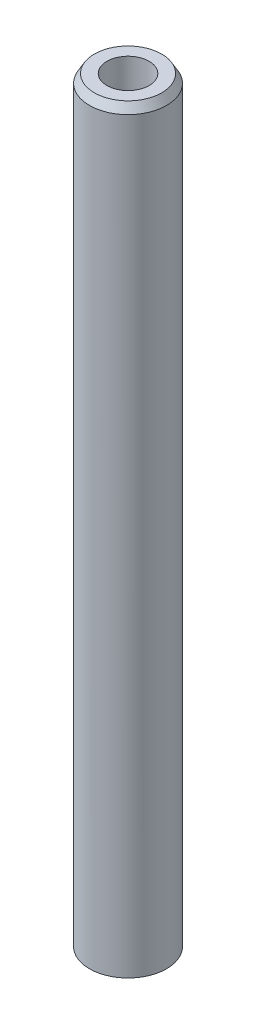
ISO-10303-21;
HEADER;
FILE_DESCRIPTION(('STEP AP214'),'2;1');
FILE_NAME('part.step','',(''),(''),'','','');
FILE_SCHEMA(('AUTOMOTIVE_DESIGN { 1 0 10303 214 1 1 1 1 }'));
ENDSEC;
DATA;
#1=APPLICATION_CONTEXT('core data for automotive mechanical design processes');
#2=APPLICATION_PROTOCOL_DEFINITION('international standard','automotive_design',2000,#1);
#3=PRODUCT_CONTEXT('',#1,'mechanical');
#4=PRODUCT('Part','Part','',(#3));
#5=PRODUCT_RELATED_PRODUCT_CATEGORY('part','',(#4));
#6=PRODUCT_DEFINITION_FORMATION('','',#4);
#7=PRODUCT_DEFINITION_CONTEXT('part definition',#1,'design');
#8=PRODUCT_DEFINITION('design','',#6,#7);
#9=PRODUCT_DEFINITION_SHAPE('','',#8);
#10=(LENGTH_UNIT() NAMED_UNIT(*) SI_UNIT(.MILLI.,.METRE.));
#11=(NAMED_UNIT(*) PLANE_ANGLE_UNIT() SI_UNIT($,.RADIAN.));
#12=(NAMED_UNIT(*) SI_UNIT($,.STERADIAN.) SOLID_ANGLE_UNIT());
#13=UNCERTAINTY_MEASURE_WITH_UNIT(LENGTH_MEASURE(1.E-05),#10,'distance_accuracy_value','');
#14=(GEOMETRIC_REPRESENTATION_CONTEXT(3) GLOBAL_UNCERTAINTY_ASSIGNED_CONTEXT((#13)) GLOBAL_UNIT_ASSIGNED_CONTEXT((#10,
#11,#12)) REPRESENTATION_CONTEXT('',''));
#15=CARTESIAN_POINT('',(0.,0.,0.));
#16=DIRECTION('',(0.,0.,1.));
#17=DIRECTION('',(1.,0.,0.));
#18=AXIS2_PLACEMENT_3D('',#15,#16,#17);
#19=CARTESIAN_POINT('',(0.,493.757873071022,0.));
#20=DIRECTION('',(0.,-1.,0.));
#21=DIRECTION('',(0.,0.,-1.));
#22=AXIS2_PLACEMENT_3D('',#19,#20,#21);
#23=CYLINDRICAL_SURFACE('',#22,25.);
#24=CARTESIAN_POINT('',(0.,488.245033458921,0.));
#25=DIRECTION('',(0.,1.,0.));
#26=DIRECTION('',(0.,0.,1.));
#27=AXIS2_PLACEMENT_3D('',#24,#25,#26);
#28=CIRCLE('',#27,25.);
#29=CARTESIAN_POINT('',(0.,488.245033458921,-25.));
#30=VERTEX_POINT('',#29);
#31=EDGE_CURVE('E50',#30,#30,#28,.F.);
#32=CARTESIAN_POINT('',(0.,3.18283943404574,0.));
#33=DIRECTION('',(0.,1.,0.));
#34=DIRECTION('',(0.,0.,1.));
#35=AXIS2_PLACEMENT_3D('',#32,#33,#34);
#36=CIRCLE('',#35,25.);
#37=CARTESIAN_POINT('',(0.,3.18283943404574,-25.));
#38=VERTEX_POINT('',#37);
#39=EDGE_CURVE('E51',#38,#38,#36,.T.);
#40=CARTESIAN_POINT('',(0.,488.245033458921,-25.));
#41=CARTESIAN_POINT('',(0.,483.192302271162,-25.));
#42=CARTESIAN_POINT('',(0.,478.139571083403,-25.));
#43=CARTESIAN_POINT('',(0.,468.034108707885,-25.));
#44=CARTESIAN_POINT('',(0.,462.981377520126,-25.));
#45=CARTESIAN_POINT('',(0.,452.875915144607,-25.));
#46=CARTESIAN_POINT('',(0.,447.823183956848,-25.));
#47=CARTESIAN_POINT('',(0.,437.71772158133,-25.));
#48=CARTESIAN_POINT('',(0.,432.664990393571,-25.));
#49=CARTESIAN_POINT('',(0.,422.559528018053,-25.));
#50=CARTESIAN_POINT('',(0.,417.506796830294,-25.));
#51=CARTESIAN_POINT('',(0.,407.401334454775,-25.));
#52=CARTESIAN_POINT('',(0.,402.348603267016,-25.));
#53=CARTESIAN_POINT('',(0.,392.243140891498,-25.));
#54=CARTESIAN_POINT('',(0.,387.190409703739,-25.));
#55=CARTESIAN_POINT('',(0.,377.084947328221,-25.));
#56=CARTESIAN_POINT('',(0.,372.032216140462,-25.));
#57=CARTESIAN_POINT('',(0.,361.926753764943,-25.));
#58=CARTESIAN_POINT('',(0.,356.874022577184,-25.));
#59=CARTESIAN_POINT('',(0.,346.768560201666,-25.));
#60=CARTESIAN_POINT('',(0.,341.715829013907,-25.));
#61=CARTESIAN_POINT('',(0.,331.610366638389,-25.));
#62=CARTESIAN_POINT('',(0.,326.557635450629,-25.));
#63=CARTESIAN_POINT('',(0.,316.452173075111,-25.));
#64=CARTESIAN_POINT('',(0.,311.399441887352,-25.));
#65=CARTESIAN_POINT('',(0.,301.293979511834,-25.));
#66=CARTESIAN_POINT('',(0.,296.241248324075,-25.));
#67=CARTESIAN_POINT('',(0.,286.135785948556,-25.));
#68=CARTESIAN_POINT('',(0.,281.083054760797,-25.));
#69=CARTESIAN_POINT('',(0.,270.977592385279,-25.));
#70=CARTESIAN_POINT('',(0.,265.92486119752,-25.));
#71=CARTESIAN_POINT('',(0.,255.819398822002,-25.));
#72=CARTESIAN_POINT('',(0.,250.766667634243,-25.));
#73=CARTESIAN_POINT('',(0.,240.661205258724,-25.));
#74=CARTESIAN_POINT('',(0.,235.608474070965,-25.));
#75=CARTESIAN_POINT('',(0.,225.503011695447,-25.));
#76=CARTESIAN_POINT('',(0.,220.450280507688,-25.));
#77=CARTESIAN_POINT('',(0.,210.34481813217,-25.));
#78=CARTESIAN_POINT('',(0.,205.292086944411,-25.));
#79=CARTESIAN_POINT('',(0.,195.186624568892,-25.));
#80=CARTESIAN_POINT('',(0.,190.133893381133,-25.));
#81=CARTESIAN_POINT('',(0.,180.028431005615,-25.));
#82=CARTESIAN_POINT('',(0.,174.975699817856,-25.));
#83=CARTESIAN_POINT('',(0.,164.870237442338,-25.));
#84=CARTESIAN_POINT('',(0.,159.817506254578,-25.));
#85=CARTESIAN_POINT('',(0.,149.71204387906,-25.));
#86=CARTESIAN_POINT('',(0.,144.659312691301,-25.));
#87=CARTESIAN_POINT('',(0.,134.553850315783,-25.));
#88=CARTESIAN_POINT('',(0.,129.501119128024,-25.));
#89=CARTESIAN_POINT('',(0.,119.395656752505,-25.));
#90=CARTESIAN_POINT('',(0.,114.342925564746,-25.));
#91=CARTESIAN_POINT('',(0.,104.237463189228,-25.));
#92=CARTESIAN_POINT('',(0.,99.184732001469,-25.));
#93=CARTESIAN_POINT('',(0.,89.0792696259508,-25.));
#94=CARTESIAN_POINT('',(0.,84.0265384381917,-25.));
#95=CARTESIAN_POINT('',(0.,73.9210760626734,-25.));
#96=CARTESIAN_POINT('',(0.,68.8683448749143,-25.));
#97=CARTESIAN_POINT('',(0.,58.762882499396,-25.));
#98=CARTESIAN_POINT('',(0.,53.7101513116369,-25.));
#99=CARTESIAN_POINT('',(0.,43.6046889361186,-25.));
#100=CARTESIAN_POINT('',(0.,38.5519577483595,-25.));
#101=CARTESIAN_POINT('',(0.,28.4464953728413,-25.));
#102=CARTESIAN_POINT('',(0.,23.3937641850822,-25.));
#103=CARTESIAN_POINT('',(0.,13.2883018095639,-25.));
#104=CARTESIAN_POINT('',(0.,8.23557062180484,-25.));
#105=CARTESIAN_POINT('',(0.,3.18283943404574,-25.));
#106=B_SPLINE_CURVE_WITH_KNOTS('',3,(#40,#41,#42,#43,#44,#45,#46,#47,#48,#49,#50,#51,#52,#53,
#54,#55,#56,#57,#58,#59,#60,#61,#62,#63,#64,#65,#66,#67,#68,#69,#70,#71,#72,#73,#74,#75,#76,#77,
#78,#79,#80,#81,#82,#83,#84,#85,#86,#87,#88,#89,#90,#91,#92,#93,#94,#95,#96,#97,#98,#99,#100,
#101,#102,#103,#104,#105),.UNSPECIFIED.,.F.,.F.,(4,2,2,2,2,2,2,2,2,2,2,2,2,2,2,2,2,2,2,2,2,2,2,
2,2,2,2,2,2,2,2,2,4),(0.,15.1581935632774,30.3163871265548,45.4745806898321,60.6327742531095,
75.7909678163868,90.9491613796642,106.107354942942,121.265548506219,136.423742069496,
151.581935632774,166.740129196051,181.898322759328,197.056516322606,212.214709885883,
227.37290344916,242.531097012438,257.689290575715,272.847484138992,288.00567770227,
303.163871265547,318.322064828825,333.480258392102,348.638451955379,363.796645518657,
378.954839081934,394.113032645211,409.271226208489,424.429419771766,439.587613335044,
454.745806898321,469.904000461598,485.062194024876),.UNSPECIFIED.);
#107=EDGE_CURVE('BSEAM39',#30,#38,#106,.T.);
#108=ORIENTED_EDGE('',*,*,#31,.T.);
#109=ORIENTED_EDGE('',*,*,#39,.T.);
#110=ORIENTED_EDGE('',*,*,#107,.T.);
#111=ORIENTED_EDGE('',*,*,#107,.F.);
#112=EDGE_LOOP('',(#108,#110,#109,#111));
#113=FACE_BOUND('',#112,.T.);
#114=ADVANCED_FACE('F39',(#113),#23,.T.);
#115=CARTESIAN_POINT('',(0.,493.757873071022,0.));
#116=DIRECTION('',(0.,1.,0.));
#117=DIRECTION('',(0.,0.,1.));
#118=AXIS2_PLACEMENT_3D('',#115,#116,#117);
#119=PLANE('',#118);
#120=CARTESIAN_POINT('',(0.,493.757873071022,0.));
#121=DIRECTION('',(0.,1.,0.));
#122=DIRECTION('',(0.,0.,1.));
#123=AXIS2_PLACEMENT_3D('',#120,#121,#122);
#124=CIRCLE('',#123,21.8171605659546);
#125=CARTESIAN_POINT('',(0.,493.757873071022,21.8171605659546));
#126=VERTEX_POINT('',#125);
#127=EDGE_CURVE('E54',#126,#126,#124,.T.);
#128=ORIENTED_EDGE('',*,*,#127,.T.);
#129=EDGE_LOOP('',(#128));
#130=FACE_BOUND('',#129,.T.);
#131=CARTESIAN_POINT('',(0.,493.757873071022,0.));
#132=DIRECTION('',(0.,1.,0.));
#133=DIRECTION('',(0.,0.,1.));
#134=AXIS2_PLACEMENT_3D('',#131,#132,#133);
#135=CIRCLE('',#134,13.6731138521703);
#136=CARTESIAN_POINT('',(0.,493.757873071022,-13.6731138521703));
#137=VERTEX_POINT('',#136);
#138=EDGE_CURVE('E58',#137,#137,#135,.T.);
#139=ORIENTED_EDGE('',*,*,#138,.F.);
#140=EDGE_LOOP('',(#139));
#141=FACE_BOUND('',#140,.T.);
#142=ADVANCED_FACE('F69',(#130,#141),#119,.T.);
#143=CARTESIAN_POINT('',(0.,0.,0.));
#144=DIRECTION('',(0.,1.,0.));
#145=DIRECTION('',(0.,0.,1.));
#146=AXIS2_PLACEMENT_3D('',#143,#144,#145);
#147=PLANE('',#146);
#148=CARTESIAN_POINT('',(0.,0.,0.));
#149=DIRECTION('',(0.,1.,0.));
#150=DIRECTION('',(0.,0.,1.));
#151=AXIS2_PLACEMENT_3D('',#148,#149,#150);
#152=CIRCLE('',#151,19.487160387899);
#153=CARTESIAN_POINT('',(0.,0.,19.487160387899));
#154=VERTEX_POINT('',#153);
#155=EDGE_CURVE('E10',#154,#154,#152,.F.);
#156=ORIENTED_EDGE('',*,*,#155,.T.);
#157=EDGE_LOOP('',(#156));
#158=FACE_BOUND('',#157,.T.);
#159=CARTESIAN_POINT('',(0.,0.,0.));
#160=DIRECTION('',(0.,1.,0.));
#161=DIRECTION('',(0.,0.,1.));
#162=AXIS2_PLACEMENT_3D('',#159,#160,#161);
#163=CIRCLE('',#162,13.6731138521703);
#164=CARTESIAN_POINT('',(0.,0.,-13.6731138521703));
#165=VERTEX_POINT('',#164);
#166=EDGE_CURVE('E63',#165,#165,#163,.T.);
#167=ORIENTED_EDGE('',*,*,#166,.T.);
#168=EDGE_LOOP('',(#167));
#169=FACE_BOUND('',#168,.T.);
#170=ADVANCED_FACE('F75',(#158,#169),#147,.F.);
#171=CARTESIAN_POINT('',(0.,493.757873071022,0.));
#172=DIRECTION('',(0.,-1.,0.));
#173=DIRECTION('',(0.,0.,-1.));
#174=AXIS2_PLACEMENT_3D('',#171,#172,#173);
#175=CYLINDRICAL_SURFACE('',#174,13.6731138521703);
#176=CARTESIAN_POINT('',(0.,493.757873071022,-13.6731138521703));
#177=CARTESIAN_POINT('',(0.,488.614561893199,-13.6731138521703));
#178=CARTESIAN_POINT('',(0.,483.471250715375,-13.6731138521703));
#179=CARTESIAN_POINT('',(0.,473.184628359729,-13.6731138521703));
#180=CARTESIAN_POINT('',(0.,468.041317181906,-13.6731138521703));
#181=CARTESIAN_POINT('',(0.,457.75469482626,-13.6731138521703));
#182=CARTESIAN_POINT('',(0.,452.611383648437,-13.6731138521703));
#183=CARTESIAN_POINT('',(0.,442.32476129279,-13.6731138521703));
#184=CARTESIAN_POINT('',(0.,437.181450114967,-13.6731138521703));
#185=CARTESIAN_POINT('',(0.,426.894827759321,-13.6731138521703));
#186=CARTESIAN_POINT('',(0.,421.751516581498,-13.6731138521703));
#187=CARTESIAN_POINT('',(0.,411.464894225851,-13.6731138521703));
#188=CARTESIAN_POINT('',(0.,406.321583048028,-13.6731138521703));
#189=CARTESIAN_POINT('',(0.,396.034960692382,-13.6731138521703));
#190=CARTESIAN_POINT('',(0.,390.891649514559,-13.6731138521703));
#191=CARTESIAN_POINT('',(0.,380.605027158913,-13.6731138521703));
#192=CARTESIAN_POINT('',(0.,375.461715981089,-13.6731138521703));
#193=CARTESIAN_POINT('',(0.,365.175093625443,-13.6731138521703));
#194=CARTESIAN_POINT('',(0.,360.03178244762,-13.6731138521703));
#195=CARTESIAN_POINT('',(0.,349.745160091974,-13.6731138521703));
#196=CARTESIAN_POINT('',(0.,344.601848914151,-13.6731138521703));
#197=CARTESIAN_POINT('',(0.,334.315226558504,-13.6731138521703));
#198=CARTESIAN_POINT('',(0.,329.171915380681,-13.6731138521703));
#199=CARTESIAN_POINT('',(0.,318.885293025035,-13.6731138521703));
#200=CARTESIAN_POINT('',(0.,313.741981847212,-13.6731138521703));
#201=CARTESIAN_POINT('',(0.,303.455359491566,-13.6731138521703));
#202=CARTESIAN_POINT('',(0.,298.312048313742,-13.6731138521703));
#203=CARTESIAN_POINT('',(0.,288.025425958096,-13.6731138521703));
#204=CARTESIAN_POINT('',(0.,282.882114780273,-13.6731138521703));
#205=CARTESIAN_POINT('',(0.,272.595492424627,-13.6731138521703));
#206=CARTESIAN_POINT('',(0.,267.452181246803,-13.6731138521703));
#207=CARTESIAN_POINT('',(0.,257.165558891157,-13.6731138521703));
#208=CARTESIAN_POINT('',(0.,252.022247713334,-13.6731138521703));
#209=CARTESIAN_POINT('',(0.,241.735625357688,-13.6731138521703));
#210=CARTESIAN_POINT('',(0.,236.592314179865,-13.6731138521703));
#211=CARTESIAN_POINT('',(0.,226.305691824218,-13.6731138521703));
#212=CARTESIAN_POINT('',(0.,221.162380646395,-13.6731138521703));
#213=CARTESIAN_POINT('',(0.,210.875758290749,-13.6731138521703));
#214=CARTESIAN_POINT('',(0.,205.732447112926,-13.6731138521703));
#215=CARTESIAN_POINT('',(0.,195.445824757279,-13.6731138521703));
#216=CARTESIAN_POINT('',(0.,190.302513579456,-13.6731138521703));
#217=CARTESIAN_POINT('',(0.,180.01589122381,-13.6731138521703));
#218=CARTESIAN_POINT('',(0.,174.872580045987,-13.6731138521703));
#219=CARTESIAN_POINT('',(0.,164.585957690341,-13.6731138521703));
#220=CARTESIAN_POINT('',(0.,159.442646512517,-13.6731138521703));
#221=CARTESIAN_POINT('',(0.,149.156024156871,-13.6731138521703));
#222=CARTESIAN_POINT('',(0.,144.012712979048,-13.6731138521703));
#223=CARTESIAN_POINT('',(0.,133.726090623402,-13.6731138521703));
#224=CARTESIAN_POINT('',(0.,128.582779445579,-13.6731138521703));
#225=CARTESIAN_POINT('',(0.,118.296157089932,-13.6731138521703));
#226=CARTESIAN_POINT('',(0.,113.152845912109,-13.6731138521703));
#227=CARTESIAN_POINT('',(0.,102.866223556463,-13.6731138521703));
#228=CARTESIAN_POINT('',(0.,97.7229123786397,-13.6731138521703));
#229=CARTESIAN_POINT('',(0.,87.4362900229935,-13.6731138521703));
#230=CARTESIAN_POINT('',(0.,82.2929788451703,-13.6731138521703));
#231=CARTESIAN_POINT('',(0.,72.006356489524,-13.6731138521703));
#232=CARTESIAN_POINT('',(0.,66.8630453117009,-13.6731138521703));
#233=CARTESIAN_POINT('',(0.,56.5764229560546,-13.6731138521703));
#234=CARTESIAN_POINT('',(0.,51.4331117782314,-13.6731138521703));
#235=CARTESIAN_POINT('',(0.,41.1464894225851,-13.6731138521703));
#236=CARTESIAN_POINT('',(0.,36.003178244762,-13.6731138521703));
#237=CARTESIAN_POINT('',(0.,25.7165558891157,-13.6731138521703));
#238=CARTESIAN_POINT('',(0.,20.5732447112926,-13.6731138521703));
#239=CARTESIAN_POINT('',(0.,10.2866223556463,-13.6731138521703));
#240=CARTESIAN_POINT('',(0.,5.14331117782315,-13.6731138521703));
#241=CARTESIAN_POINT('',(0.,0.,-13.6731138521703));
#242=B_SPLINE_CURVE_WITH_KNOTS('',3,(#176,#177,#178,#179,#180,#181,#182,#183,#184,#185,#186,
#187,#188,#189,#190,#191,#192,#193,#194,#195,#196,#197,#198,#199,#200,#201,#202,#203,#204,#205,
#206,#207,#208,#209,#210,#211,#212,#213,#214,#215,#216,#217,#218,#219,#220,#221,#222,#223,#224,
#225,#226,#227,#228,#229,#230,#231,#232,#233,#234,#235,#236,#237,#238,#239,#240,#241),
.UNSPECIFIED.,.F.,.F.,(4,2,2,2,2,2,2,2,2,2,2,2,2,2,2,2,2,2,2,2,2,2,2,2,2,2,2,2,2,2,2,2,4),(0.,
15.4299335334694,30.8598670669388,46.2898006004083,61.7197341338777,77.1496676673471,
92.5796012008165,108.009534734286,123.439468267755,138.869401801225,154.299335334694,
169.729268868164,185.159202401633,200.589135935103,216.019069468572,231.449003002041,
246.878936535511,262.30887006898,277.73880360245,293.168737135919,308.598670669389,
324.028604202858,339.458537736327,354.888471269797,370.318404803266,385.748338336736,
401.178271870205,416.608205403675,432.038138937144,447.468072470613,462.898006004083,
478.327939537552,493.757873071022),.UNSPECIFIED.);
#243=EDGE_CURVE('BSEAM70',#137,#165,#242,.T.);
#244=ORIENTED_EDGE('',*,*,#138,.T.);
#245=ORIENTED_EDGE('',*,*,#166,.F.);
#246=ORIENTED_EDGE('',*,*,#243,.T.);
#247=ORIENTED_EDGE('',*,*,#243,.F.);
#248=EDGE_LOOP('',(#244,#246,#245,#247));
#249=FACE_BOUND('',#248,.T.);
#250=ADVANCED_FACE('F70',(#249),#175,.F.);
#251=CARTESIAN_POINT('',(0.,493.757873071022,0.));
#252=DIRECTION('',(0.,-1.,0.));
#253=DIRECTION('',(0.,0.,-1.));
#254=AXIS2_PLACEMENT_3D('',#251,#252,#253);
#255=CONICAL_SURFACE('',#254,21.8171605659546,0.523598775598299);
#256=ORIENTED_EDGE('',*,*,#31,.F.);
#257=EDGE_LOOP('',(#256));
#258=FACE_BOUND('',#257,.T.);
#259=ORIENTED_EDGE('',*,*,#127,.F.);
#260=EDGE_LOOP('',(#259));
#261=FACE_BOUND('',#260,.T.);
#262=ADVANCED_FACE('F81',(#258,#261),#255,.T.);
#263=CARTESIAN_POINT('',(0.,3.18283943404574,0.));
#264=DIRECTION('',(0.,1.,0.));
#265=DIRECTION('',(0.,0.,1.));
#266=AXIS2_PLACEMENT_3D('',#263,#264,#265);
#267=CONICAL_SURFACE('',#266,25.,1.0471975511966);
#268=ORIENTED_EDGE('',*,*,#155,.F.);
#269=EDGE_LOOP('',(#268));
#270=FACE_BOUND('',#269,.T.);
#271=ORIENTED_EDGE('',*,*,#39,.F.);
#272=EDGE_LOOP('',(#271));
#273=FACE_BOUND('',#272,.T.);
#274=ADVANCED_FACE('F45',(#270,#273),#267,.T.);
#275=CLOSED_SHELL('',(#114,#142,#170,#250,#262,#274));
#276=MANIFOLD_SOLID_BREP('B2',#275);
#277=ADVANCED_BREP_SHAPE_REPRESENTATION('',(#18,#276),#14);
#278=SHAPE_DEFINITION_REPRESENTATION(#9,#277);
ENDSEC;
END-ISO-10303-21;
